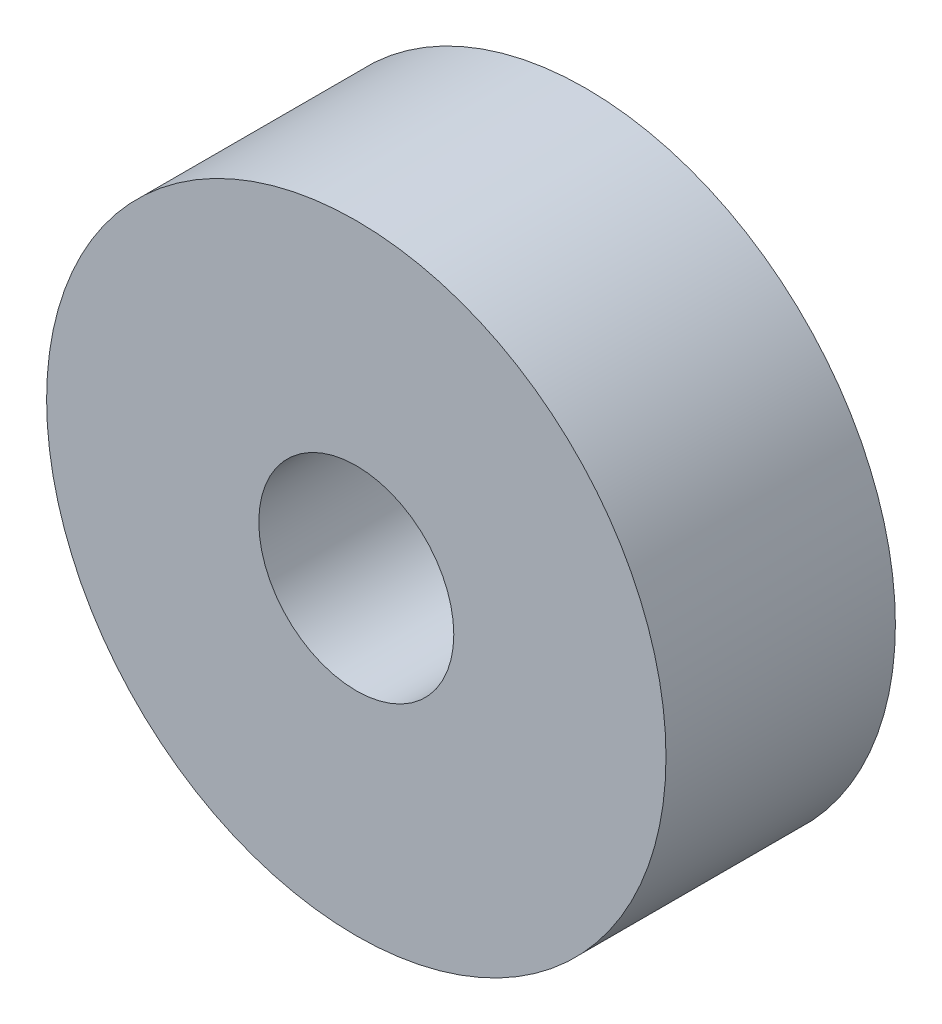
ISO-10303-21;
HEADER;
FILE_DESCRIPTION(('STEP AP214'),'2;1');
FILE_NAME('part.step','',(''),(''),'','','');
FILE_SCHEMA(('AUTOMOTIVE_DESIGN { 1 0 10303 214 1 1 1 1 }'));
ENDSEC;
DATA;
#1=APPLICATION_CONTEXT('core data for automotive mechanical design processes');
#2=APPLICATION_PROTOCOL_DEFINITION('international standard','automotive_design',2000,#1);
#3=PRODUCT_CONTEXT('',#1,'mechanical');
#4=PRODUCT('Part','Part','',(#3));
#5=PRODUCT_RELATED_PRODUCT_CATEGORY('part','',(#4));
#6=PRODUCT_DEFINITION_FORMATION('','',#4);
#7=PRODUCT_DEFINITION_CONTEXT('part definition',#1,'design');
#8=PRODUCT_DEFINITION('design','',#6,#7);
#9=PRODUCT_DEFINITION_SHAPE('','',#8);
#10=(LENGTH_UNIT() NAMED_UNIT(*) SI_UNIT(.MILLI.,.METRE.));
#11=(NAMED_UNIT(*) PLANE_ANGLE_UNIT() SI_UNIT($,.RADIAN.));
#12=(NAMED_UNIT(*) SI_UNIT($,.STERADIAN.) SOLID_ANGLE_UNIT());
#13=UNCERTAINTY_MEASURE_WITH_UNIT(LENGTH_MEASURE(1.E-05),#10,'distance_accuracy_value','');
#14=(GEOMETRIC_REPRESENTATION_CONTEXT(3) GLOBAL_UNCERTAINTY_ASSIGNED_CONTEXT((#13)) GLOBAL_UNIT_ASSIGNED_CONTEXT((#10,
#11,#12)) REPRESENTATION_CONTEXT('',''));
#15=CARTESIAN_POINT('',(0.,0.,0.));
#16=DIRECTION('',(0.,0.,1.));
#17=DIRECTION('',(1.,0.,0.));
#18=AXIS2_PLACEMENT_3D('',#15,#16,#17);
#19=CARTESIAN_POINT('',(0.,0.,20.));
#20=DIRECTION('',(0.,0.,-1.));
#21=DIRECTION('',(-1.,0.,0.));
#22=AXIS2_PLACEMENT_3D('',#19,#20,#21);
#23=CYLINDRICAL_SURFACE('',#22,27.);
#24=CARTESIAN_POINT('',(0.,0.,20.));
#25=DIRECTION('',(0.,0.,1.));
#26=DIRECTION('',(1.,0.,0.));
#27=AXIS2_PLACEMENT_3D('',#24,#25,#26);
#28=CIRCLE('',#27,27.);
#29=CARTESIAN_POINT('',(27.,0.,20.));
#30=VERTEX_POINT('',#29);
#31=EDGE_CURVE('E10',#30,#30,#28,.T.);
#32=ORIENTED_EDGE('',*,*,#31,.F.);
#33=EDGE_LOOP('',(#32));
#34=FACE_BOUND('',#33,.T.);
#35=CARTESIAN_POINT('',(0.,0.,0.));
#36=DIRECTION('',(0.,0.,1.));
#37=DIRECTION('',(1.,0.,0.));
#38=AXIS2_PLACEMENT_3D('',#35,#36,#37);
#39=CIRCLE('',#38,27.);
#40=CARTESIAN_POINT('',(27.,0.,0.));
#41=VERTEX_POINT('',#40);
#42=EDGE_CURVE('E34',#41,#41,#39,.T.);
#43=ORIENTED_EDGE('',*,*,#42,.T.);
#44=EDGE_LOOP('',(#43));
#45=FACE_BOUND('',#44,.T.);
#46=ADVANCED_FACE('F31',(#34,#45),#23,.T.);
#47=CARTESIAN_POINT('',(0.,0.,20.));
#48=DIRECTION('',(0.,0.,1.));
#49=DIRECTION('',(1.,0.,0.));
#50=AXIS2_PLACEMENT_3D('',#47,#48,#49);
#51=PLANE('',#50);
#52=CARTESIAN_POINT('',(0.,0.,20.));
#53=DIRECTION('',(0.,0.,1.));
#54=DIRECTION('',(1.,0.,0.));
#55=AXIS2_PLACEMENT_3D('',#52,#53,#54);
#56=CIRCLE('',#55,8.5);
#57=CARTESIAN_POINT('',(8.5,0.,20.));
#58=VERTEX_POINT('',#57);
#59=EDGE_CURVE('E45',#58,#58,#56,.T.);
#60=ORIENTED_EDGE('',*,*,#59,.F.);
#61=EDGE_LOOP('',(#60));
#62=FACE_BOUND('',#61,.T.);
#63=ORIENTED_EDGE('',*,*,#31,.T.);
#64=EDGE_LOOP('',(#63));
#65=FACE_BOUND('',#64,.T.);
#66=ADVANCED_FACE('F52',(#62,#65),#51,.T.);
#67=CARTESIAN_POINT('',(0.,0.,0.));
#68=DIRECTION('',(0.,0.,1.));
#69=DIRECTION('',(1.,0.,0.));
#70=AXIS2_PLACEMENT_3D('',#67,#68,#69);
#71=PLANE('',#70);
#72=CARTESIAN_POINT('',(0.,0.,0.));
#73=DIRECTION('',(0.,0.,1.));
#74=DIRECTION('',(1.,0.,0.));
#75=AXIS2_PLACEMENT_3D('',#72,#73,#74);
#76=CIRCLE('',#75,8.5);
#77=CARTESIAN_POINT('',(8.5,0.,0.));
#78=VERTEX_POINT('',#77);
#79=EDGE_CURVE('E41',#78,#78,#76,.F.);
#80=ORIENTED_EDGE('',*,*,#79,.F.);
#81=EDGE_LOOP('',(#80));
#82=FACE_BOUND('',#81,.T.);
#83=ORIENTED_EDGE('',*,*,#42,.F.);
#84=EDGE_LOOP('',(#83));
#85=FACE_BOUND('',#84,.T.);
#86=ADVANCED_FACE('F54',(#82,#85),#71,.F.);
#87=CARTESIAN_POINT('',(0.,0.,-0.001000000000001));
#88=DIRECTION('',(0.,0.,1.));
#89=DIRECTION('',(1.,0.,0.));
#90=AXIS2_PLACEMENT_3D('',#87,#88,#89);
#91=CYLINDRICAL_SURFACE('',#90,8.5);
#92=ORIENTED_EDGE('',*,*,#59,.T.);
#93=EDGE_LOOP('',(#92));
#94=FACE_BOUND('',#93,.T.);
#95=ORIENTED_EDGE('',*,*,#79,.T.);
#96=EDGE_LOOP('',(#95));
#97=FACE_BOUND('',#96,.T.);
#98=ADVANCED_FACE('F49',(#94,#97),#91,.F.);
#99=CLOSED_SHELL('',(#46,#66,#86,#98));
#100=MANIFOLD_SOLID_BREP('B2',#99);
#101=ADVANCED_BREP_SHAPE_REPRESENTATION('',(#18,#100),#14);
#102=SHAPE_DEFINITION_REPRESENTATION(#9,#101);
ENDSEC;
END-ISO-10303-21;
